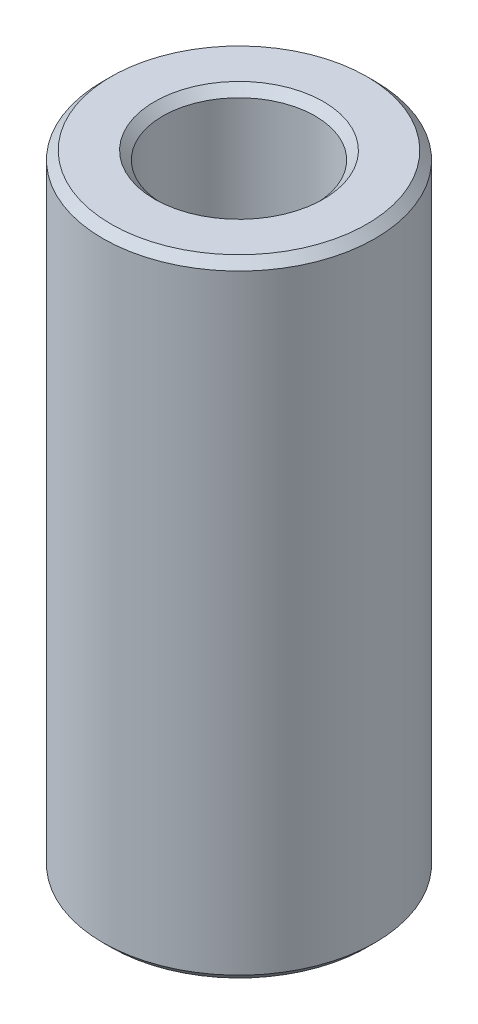
ISO-10303-21;
HEADER;
FILE_DESCRIPTION(('STEP AP214'),'2;1');
FILE_NAME('part.step','',(''),(''),'','','');
FILE_SCHEMA(('AUTOMOTIVE_DESIGN { 1 0 10303 214 1 1 1 1 }'));
ENDSEC;
DATA;
#1=APPLICATION_CONTEXT('core data for automotive mechanical design processes');
#2=APPLICATION_PROTOCOL_DEFINITION('international standard','automotive_design',2000,#1);
#3=PRODUCT_CONTEXT('',#1,'mechanical');
#4=PRODUCT('Part','Part','',(#3));
#5=PRODUCT_RELATED_PRODUCT_CATEGORY('part','',(#4));
#6=PRODUCT_DEFINITION_FORMATION('','',#4);
#7=PRODUCT_DEFINITION_CONTEXT('part definition',#1,'design');
#8=PRODUCT_DEFINITION('design','',#6,#7);
#9=PRODUCT_DEFINITION_SHAPE('','',#8);
#10=(LENGTH_UNIT() NAMED_UNIT(*) SI_UNIT(.MILLI.,.METRE.));
#11=(NAMED_UNIT(*) PLANE_ANGLE_UNIT() SI_UNIT($,.RADIAN.));
#12=(NAMED_UNIT(*) SI_UNIT($,.STERADIAN.) SOLID_ANGLE_UNIT());
#13=UNCERTAINTY_MEASURE_WITH_UNIT(LENGTH_MEASURE(1.E-05),#10,'distance_accuracy_value','');
#14=(GEOMETRIC_REPRESENTATION_CONTEXT(3) GLOBAL_UNCERTAINTY_ASSIGNED_CONTEXT((#13)) GLOBAL_UNIT_ASSIGNED_CONTEXT((#10,
#11,#12)) REPRESENTATION_CONTEXT('',''));
#15=CARTESIAN_POINT('',(0.,0.,0.));
#16=DIRECTION('',(0.,0.,1.));
#17=DIRECTION('',(1.,0.,0.));
#18=AXIS2_PLACEMENT_3D('',#15,#16,#17);
#19=CARTESIAN_POINT('',(0.,207.014856227044,0.));
#20=DIRECTION('',(0.,-1.,0.));
#21=DIRECTION('',(0.,0.,-1.));
#22=AXIS2_PLACEMENT_3D('',#19,#20,#21);
#23=CYLINDRICAL_SURFACE('',#22,45.);
#24=CARTESIAN_POINT('',(0.,2.74339608447646,0.));
#25=DIRECTION('',(0.,1.,0.));
#26=DIRECTION('',(0.,0.,1.));
#27=AXIS2_PLACEMENT_3D('',#24,#25,#26);
#28=CIRCLE('',#27,45.);
#29=CARTESIAN_POINT('',(0.,2.74339608447646,45.));
#30=VERTEX_POINT('',#29);
#31=EDGE_CURVE('E10',#30,#30,#28,.T.);
#32=ORIENTED_EDGE('',*,*,#31,.T.);
#33=EDGE_LOOP('',(#32));
#34=FACE_BOUND('',#33,.T.);
#35=CARTESIAN_POINT('',(0.,204.271460142568,0.));
#36=DIRECTION('',(0.,1.,0.));
#37=DIRECTION('',(0.,0.,1.));
#38=AXIS2_PLACEMENT_3D('',#35,#36,#37);
#39=CIRCLE('',#38,45.);
#40=CARTESIAN_POINT('',(0.,204.271460142568,45.));
#41=VERTEX_POINT('',#40);
#42=EDGE_CURVE('E50',#41,#41,#39,.F.);
#43=ORIENTED_EDGE('',*,*,#42,.T.);
#44=EDGE_LOOP('',(#43));
#45=FACE_BOUND('',#44,.T.);
#46=ADVANCED_FACE('F39',(#34,#45),#23,.T.);
#47=CARTESIAN_POINT('',(0.,207.014856227044,0.));
#48=DIRECTION('',(0.,1.,0.));
#49=DIRECTION('',(0.,0.,1.));
#50=AXIS2_PLACEMENT_3D('',#47,#48,#49);
#51=PLANE('',#50);
#52=CARTESIAN_POINT('',(0.,207.014856227044,0.));
#53=DIRECTION('',(0.,1.,0.));
#54=DIRECTION('',(0.,0.,1.));
#55=AXIS2_PLACEMENT_3D('',#52,#53,#54);
#56=CIRCLE('',#55,27.9201941923359);
#57=CARTESIAN_POINT('',(0.,207.014856227044,27.9201941923359));
#58=VERTEX_POINT('',#57);
#59=EDGE_CURVE('E58',#58,#58,#56,.F.);
#60=ORIENTED_EDGE('',*,*,#59,.T.);
#61=EDGE_LOOP('',(#60));
#62=FACE_BOUND('',#61,.T.);
#63=CARTESIAN_POINT('',(0.,207.014856227044,0.));
#64=DIRECTION('',(0.,1.,0.));
#65=DIRECTION('',(0.,0.,1.));
#66=AXIS2_PLACEMENT_3D('',#63,#64,#65);
#67=CIRCLE('',#66,42.2566039155235);
#68=CARTESIAN_POINT('',(0.,207.014856227044,42.2566039155235));
#69=VERTEX_POINT('',#68);
#70=EDGE_CURVE('E61',#69,#69,#67,.T.);
#71=ORIENTED_EDGE('',*,*,#70,.T.);
#72=EDGE_LOOP('',(#71));
#73=FACE_BOUND('',#72,.T.);
#74=ADVANCED_FACE('F88',(#62,#73),#51,.T.);
#75=CARTESIAN_POINT('',(0.,0.,0.));
#76=DIRECTION('',(0.,1.,0.));
#77=DIRECTION('',(0.,0.,1.));
#78=AXIS2_PLACEMENT_3D('',#75,#76,#77);
#79=PLANE('',#78);
#80=CARTESIAN_POINT('',(0.,0.,0.));
#81=DIRECTION('',(0.,1.,0.));
#82=DIRECTION('',(0.,0.,1.));
#83=AXIS2_PLACEMENT_3D('',#80,#81,#82);
#84=CIRCLE('',#83,27.9201941923359);
#85=CARTESIAN_POINT('',(0.,0.,-27.9201941923359));
#86=VERTEX_POINT('',#85);
#87=EDGE_CURVE('E51',#86,#86,#84,.T.);
#88=ORIENTED_EDGE('',*,*,#87,.T.);
#89=EDGE_LOOP('',(#88));
#90=FACE_BOUND('',#89,.T.);
#91=CARTESIAN_POINT('',(0.,0.,0.));
#92=DIRECTION('',(0.,1.,0.));
#93=DIRECTION('',(0.,0.,1.));
#94=AXIS2_PLACEMENT_3D('',#91,#92,#93);
#95=CIRCLE('',#94,42.2566039155235);
#96=CARTESIAN_POINT('',(0.,0.,42.2566039155235));
#97=VERTEX_POINT('',#96);
#98=EDGE_CURVE('E54',#97,#97,#95,.F.);
#99=ORIENTED_EDGE('',*,*,#98,.T.);
#100=EDGE_LOOP('',(#99));
#101=FACE_BOUND('',#100,.T.);
#102=ADVANCED_FACE('F83',(#90,#101),#79,.F.);
#103=CARTESIAN_POINT('',(0.,207.014856227044,0.));
#104=DIRECTION('',(0.,-1.,0.));
#105=DIRECTION('',(0.,0.,-1.));
#106=AXIS2_PLACEMENT_3D('',#103,#104,#105);
#107=CYLINDRICAL_SURFACE('',#106,25.1767981078594);
#108=CARTESIAN_POINT('',(0.,204.271460142568,0.));
#109=DIRECTION('',(0.,1.,0.));
#110=DIRECTION('',(0.,0.,1.));
#111=AXIS2_PLACEMENT_3D('',#108,#109,#110);
#112=CIRCLE('',#111,25.1767981078594);
#113=CARTESIAN_POINT('',(0.,204.271460142568,25.1767981078594));
#114=VERTEX_POINT('',#113);
#115=EDGE_CURVE('E67',#114,#114,#112,.T.);
#116=ORIENTED_EDGE('',*,*,#115,.T.);
#117=EDGE_LOOP('',(#116));
#118=FACE_BOUND('',#117,.T.);
#119=CARTESIAN_POINT('',(0.,2.74339608447649,0.));
#120=DIRECTION('',(0.,1.,0.));
#121=DIRECTION('',(0.,0.,1.));
#122=AXIS2_PLACEMENT_3D('',#119,#120,#121);
#123=CIRCLE('',#122,25.1767981078594);
#124=CARTESIAN_POINT('',(0.,2.74339608447649,-25.1767981078594));
#125=VERTEX_POINT('',#124);
#126=EDGE_CURVE('E69',#125,#125,#123,.F.);
#127=ORIENTED_EDGE('',*,*,#126,.T.);
#128=EDGE_LOOP('',(#127));
#129=FACE_BOUND('',#128,.T.);
#130=ADVANCED_FACE('F71',(#118,#129),#107,.F.);
#131=CARTESIAN_POINT('',(0.,204.271460142568,0.));
#132=DIRECTION('',(0.,1.,0.));
#133=DIRECTION('',(0.,0.,1.));
#134=AXIS2_PLACEMENT_3D('',#131,#132,#133);
#135=CONICAL_SURFACE('',#134,25.1767981078594,0.785398163397448);
#136=ORIENTED_EDGE('',*,*,#59,.F.);
#137=EDGE_LOOP('',(#136));
#138=FACE_BOUND('',#137,.T.);
#139=ORIENTED_EDGE('',*,*,#115,.F.);
#140=EDGE_LOOP('',(#139));
#141=FACE_BOUND('',#140,.T.);
#142=ADVANCED_FACE('F77',(#138,#141),#135,.F.);
#143=CARTESIAN_POINT('',(0.,0.,0.));
#144=DIRECTION('',(0.,-1.,0.));
#145=DIRECTION('',(0.,0.,-1.));
#146=AXIS2_PLACEMENT_3D('',#143,#144,#145);
#147=CONICAL_SURFACE('',#146,27.9201941923359,0.785398163397447);
#148=CARTESIAN_POINT('',(0.,2.74339608447649,-25.1767981078594));
#149=CARTESIAN_POINT('',(0.,2.71481904192986,-25.2053751504061));
#150=CARTESIAN_POINT('',(0.,2.68624199938323,-25.2339521929527));
#151=CARTESIAN_POINT('',(0.,2.62908791428997,-25.2911062780459));
#152=CARTESIAN_POINT('',(0.,2.60051087174334,-25.3196833205926));
#153=CARTESIAN_POINT('',(0.,2.54335678665008,-25.3768374056858));
#154=CARTESIAN_POINT('',(0.,2.51477974410345,-25.4054144482325));
#155=CARTESIAN_POINT('',(0.,2.45762565901019,-25.4625685333257));
#156=CARTESIAN_POINT('',(0.,2.42904861646356,-25.4911455758723));
#157=CARTESIAN_POINT('',(0.,2.3718945313703,-25.5482996609656));
#158=CARTESIAN_POINT('',(0.,2.34331748882367,-25.5768767035122));
#159=CARTESIAN_POINT('',(0.,2.28616340373041,-25.6340307886055));
#160=CARTESIAN_POINT('',(0.,2.25758636118378,-25.6626078311521));
#161=CARTESIAN_POINT('',(0.,2.20043227609052,-25.7197619162454));
#162=CARTESIAN_POINT('',(0.,2.17185523354389,-25.748338958792));
#163=CARTESIAN_POINT('',(0.,2.11470114845063,-25.8054930438853));
#164=CARTESIAN_POINT('',(0.,2.086124105904,-25.8340700864319));
#165=CARTESIAN_POINT('',(0.,2.02897002081074,-25.8912241715252));
#166=CARTESIAN_POINT('',(0.,2.00039297826411,-25.9198012140718));
#167=CARTESIAN_POINT('',(0.,1.94323889317085,-25.9769552991651));
#168=CARTESIAN_POINT('',(0.,1.91466185062422,-26.0055323417117));
#169=CARTESIAN_POINT('',(0.,1.85750776553096,-26.062686426805));
#170=CARTESIAN_POINT('',(0.,1.82893072298433,-26.0912634693516));
#171=CARTESIAN_POINT('',(0.,1.77177663789107,-26.1484175544448));
#172=CARTESIAN_POINT('',(0.,1.74319959534444,-26.1769945969915));
#173=CARTESIAN_POINT('',(0.,1.68604551025118,-26.2341486820847));
#174=CARTESIAN_POINT('',(0.,1.65746846770455,-26.2627257246314));
#175=CARTESIAN_POINT('',(0.,1.60031438261129,-26.3198798097246));
#176=CARTESIAN_POINT('',(0.,1.57173734006466,-26.3484568522712));
#177=CARTESIAN_POINT('',(0.,1.5145832549714,-26.4056109373645));
#178=CARTESIAN_POINT('',(0.,1.48600621242477,-26.4341879799111));
#179=CARTESIAN_POINT('',(0.,1.42885212733151,-26.4913420650044));
#180=CARTESIAN_POINT('',(0.,1.40027508478488,-26.519919107551));
#181=CARTESIAN_POINT('',(0.,1.34312099969161,-26.5770731926443));
#182=CARTESIAN_POINT('',(0.,1.31454395714498,-26.6056502351909));
#183=CARTESIAN_POINT('',(0.,1.25738987205172,-26.6628043202842));
#184=CARTESIAN_POINT('',(0.,1.22881282950509,-26.6913813628308));
#185=CARTESIAN_POINT('',(0.,1.17165874441183,-26.7485354479241));
#186=CARTESIAN_POINT('',(0.,1.1430817018652,-26.7771124904707));
#187=CARTESIAN_POINT('',(0.,1.08592761677194,-26.834266575564));
#188=CARTESIAN_POINT('',(0.,1.05735057422531,-26.8628436181106));
#189=CARTESIAN_POINT('',(0.,1.00019648913205,-26.9199977032039));
#190=CARTESIAN_POINT('',(0.,0.971619446585424,-26.9485747457505));
#191=CARTESIAN_POINT('',(0.,0.914465361492163,-27.0057288308437));
#192=CARTESIAN_POINT('',(0.,0.885888318945533,-27.0343058733904));
#193=CARTESIAN_POINT('',(0.,0.828734233852273,-27.0914599584836));
#194=CARTESIAN_POINT('',(0.,0.800157191305643,-27.1200370010303));
#195=CARTESIAN_POINT('',(0.,0.743003106212383,-27.1771910861235));
#196=CARTESIAN_POINT('',(0.,0.714426063665753,-27.2057681286702));
#197=CARTESIAN_POINT('',(0.,0.657271978572493,-27.2629222137634));
#198=CARTESIAN_POINT('',(0.,0.628694936025862,-27.29149925631));
#199=CARTESIAN_POINT('',(0.,0.571540850932602,-27.3486533414033));
#200=CARTESIAN_POINT('',(0.,0.542963808385972,-27.3772303839499));
#201=CARTESIAN_POINT('',(0.,0.485809723292712,-27.4343844690432));
#202=CARTESIAN_POINT('',(0.,0.457232680746082,-27.4629615115898));
#203=CARTESIAN_POINT('',(0.,0.400078595652821,-27.5201155966831));
#204=CARTESIAN_POINT('',(0.,0.371501553106191,-27.5486926392297));
#205=CARTESIAN_POINT('',(0.,0.314347468012931,-27.605846724323));
#206=CARTESIAN_POINT('',(0.,0.285770425466301,-27.6344237668696));
#207=CARTESIAN_POINT('',(0.,0.228616340373041,-27.6915778519629));
#208=CARTESIAN_POINT('',(0.,0.200039297826411,-27.7201548945095));
#209=CARTESIAN_POINT('',(0.,0.142885212733151,-27.7773089796028));
#210=CARTESIAN_POINT('',(0.,0.11430817018652,-27.8058860221494));
#211=CARTESIAN_POINT('',(0.,0.0571540850932602,-27.8630401072426));
#212=CARTESIAN_POINT('',(0.,0.0285770425466301,-27.8916171497893));
#213=CARTESIAN_POINT('',(0.,0.,-27.9201941923359));
#214=B_SPLINE_CURVE_WITH_KNOTS('',3,(#148,#149,#150,#151,#152,#153,#154,#155,#156,#157,#158,
#159,#160,#161,#162,#163,#164,#165,#166,#167,#168,#169,#170,#171,#172,#173,#174,#175,#176,#177,
#178,#179,#180,#181,#182,#183,#184,#185,#186,#187,#188,#189,#190,#191,#192,#193,#194,#195,#196,
#197,#198,#199,#200,#201,#202,#203,#204,#205,#206,#207,#208,#209,#210,#211,#212,#213),
.UNSPECIFIED.,.F.,.F.,(4,2,2,2,2,2,2,2,2,2,2,2,2,2,2,2,2,2,2,2,2,2,2,2,2,2,2,2,2,2,2,2,4),(0.,
0.121242123425872,0.242484246851744,0.363726370277615,0.484968493703487,0.606210617129359,
0.727452740555231,0.848694863981103,0.969936987406974,1.09117911083284,1.21242123425872,
1.33366335768459,1.45490548111046,1.57614760453633,1.6973897279622,1.81863185138807,
1.93987397481395,2.06111609823982,2.18235822166569,2.30360034509156,2.42484246851743,
2.5460845919433,2.66732671536918,2.78856883879505,2.90981096222092,3.03105308564679,
3.15229520907266,3.27353733249853,3.3947794559244,3.51602157935028,3.63726370277615,
3.75850582620202,3.87974794962789),.UNSPECIFIED.);
#215=EDGE_CURVE('BSEAM73',#125,#86,#214,.T.);
#216=ORIENTED_EDGE('',*,*,#126,.F.);
#217=ORIENTED_EDGE('',*,*,#87,.F.);
#218=ORIENTED_EDGE('',*,*,#215,.T.);
#219=ORIENTED_EDGE('',*,*,#215,.F.);
#220=EDGE_LOOP('',(#216,#218,#217,#219));
#221=FACE_BOUND('',#220,.T.);
#222=ADVANCED_FACE('F73',(#221),#147,.F.);
#223=CARTESIAN_POINT('',(0.,2.74339608447646,0.));
#224=DIRECTION('',(0.,1.,0.));
#225=DIRECTION('',(0.,0.,1.));
#226=AXIS2_PLACEMENT_3D('',#223,#224,#225);
#227=CONICAL_SURFACE('',#226,45.,0.785398163397448);
#228=ORIENTED_EDGE('',*,*,#98,.F.);
#229=EDGE_LOOP('',(#228));
#230=FACE_BOUND('',#229,.T.);
#231=ORIENTED_EDGE('',*,*,#31,.F.);
#232=EDGE_LOOP('',(#231));
#233=FACE_BOUND('',#232,.T.);
#234=ADVANCED_FACE('F76',(#230,#233),#227,.T.);
#235=CARTESIAN_POINT('',(0.,207.014856227044,0.));
#236=DIRECTION('',(0.,-1.,0.));
#237=DIRECTION('',(0.,0.,-1.));
#238=AXIS2_PLACEMENT_3D('',#235,#236,#237);
#239=CONICAL_SURFACE('',#238,42.2566039155235,0.785398163397447);
#240=ORIENTED_EDGE('',*,*,#42,.F.);
#241=EDGE_LOOP('',(#240));
#242=FACE_BOUND('',#241,.T.);
#243=ORIENTED_EDGE('',*,*,#70,.F.);
#244=EDGE_LOOP('',(#243));
#245=FACE_BOUND('',#244,.T.);
#246=ADVANCED_FACE('F45',(#242,#245),#239,.T.);
#247=CLOSED_SHELL('',(#46,#74,#102,#130,#142,#222,#234,#246));
#248=MANIFOLD_SOLID_BREP('B2',#247);
#249=ADVANCED_BREP_SHAPE_REPRESENTATION('',(#18,#248),#14);
#250=SHAPE_DEFINITION_REPRESENTATION(#9,#249);
ENDSEC;
END-ISO-10303-21;
